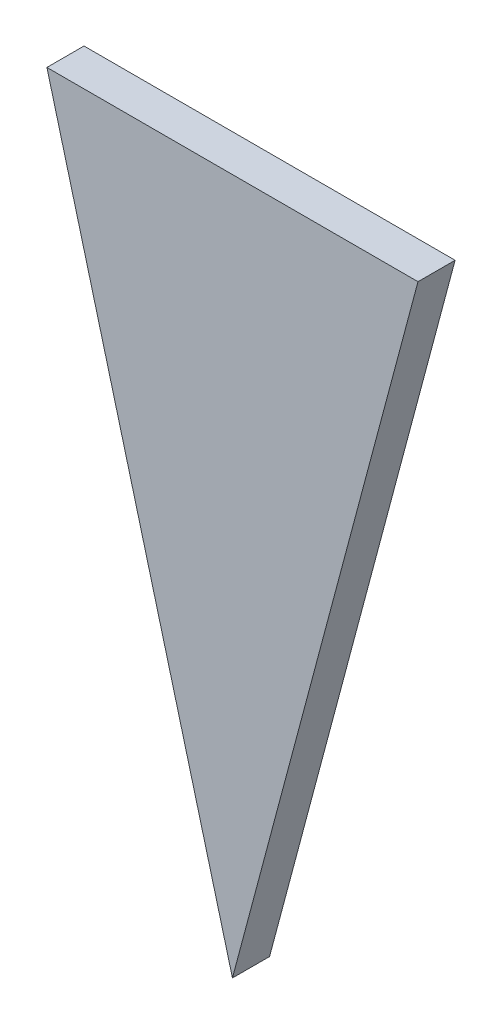
ISO-10303-21;
HEADER;
FILE_DESCRIPTION(('STEP AP214'),'2;1');
FILE_NAME('part.step','',(''),(''),'','','');
FILE_SCHEMA(('AUTOMOTIVE_DESIGN { 1 0 10303 214 1 1 1 1 }'));
ENDSEC;
DATA;
#1=APPLICATION_CONTEXT('core data for automotive mechanical design processes');
#2=APPLICATION_PROTOCOL_DEFINITION('international standard','automotive_design',2000,#1);
#3=PRODUCT_CONTEXT('',#1,'mechanical');
#4=PRODUCT('Part','Part','',(#3));
#5=PRODUCT_RELATED_PRODUCT_CATEGORY('part','',(#4));
#6=PRODUCT_DEFINITION_FORMATION('','',#4);
#7=PRODUCT_DEFINITION_CONTEXT('part definition',#1,'design');
#8=PRODUCT_DEFINITION('design','',#6,#7);
#9=PRODUCT_DEFINITION_SHAPE('','',#8);
#10=(LENGTH_UNIT() NAMED_UNIT(*) SI_UNIT(.MILLI.,.METRE.));
#11=(NAMED_UNIT(*) PLANE_ANGLE_UNIT() SI_UNIT($,.RADIAN.));
#12=(NAMED_UNIT(*) SI_UNIT($,.STERADIAN.) SOLID_ANGLE_UNIT());
#13=UNCERTAINTY_MEASURE_WITH_UNIT(LENGTH_MEASURE(1.E-05),#10,'distance_accuracy_value','');
#14=(GEOMETRIC_REPRESENTATION_CONTEXT(3) GLOBAL_UNCERTAINTY_ASSIGNED_CONTEXT((#13)) GLOBAL_UNIT_ASSIGNED_CONTEXT((#10,
#11,#12)) REPRESENTATION_CONTEXT('',''));
#15=CARTESIAN_POINT('',(0.,0.,0.));
#16=DIRECTION('',(0.,0.,1.));
#17=DIRECTION('',(1.,0.,0.));
#18=AXIS2_PLACEMENT_3D('',#15,#16,#17);
#19=CARTESIAN_POINT('',(0.,0.,0.2032));
#20=DIRECTION('',(0.,0.,1.));
#21=DIRECTION('',(1.,0.,0.));
#22=AXIS2_PLACEMENT_3D('',#19,#20,#21);
#23=PLANE('',#22);
#24=DIRECTION('',(-1.,0.,0.));
#25=VECTOR('',#24,1.);
#26=CARTESIAN_POINT('',(1.016,0.,0.2032));
#27=LINE('',#26,#25);
#28=CARTESIAN_POINT('',(1.016,0.,0.2032));
#29=VERTEX_POINT('',#28);
#30=CARTESIAN_POINT('',(-1.016,0.,0.2032));
#31=VERTEX_POINT('',#30);
#32=EDGE_CURVE('E10',#29,#31,#27,.T.);
#33=ORIENTED_EDGE('',*,*,#32,.T.);
#34=DIRECTION('',(0.257662650560332,-0.966234939601246,0.));
#35=VECTOR('',#34,1.);
#36=CARTESIAN_POINT('',(-1.016,0.,0.2032));
#37=LINE('',#36,#35);
#38=CARTESIAN_POINT('',(0.,-3.81,0.2032));
#39=VERTEX_POINT('',#38);
#40=EDGE_CURVE('E23',#31,#39,#37,.T.);
#41=ORIENTED_EDGE('',*,*,#40,.T.);
#42=DIRECTION('',(0.257662650560332,0.966234939601246,0.));
#43=VECTOR('',#42,1.);
#44=CARTESIAN_POINT('',(0.,-3.81,0.2032));
#45=LINE('',#44,#43);
#46=EDGE_CURVE('E139',#39,#29,#45,.T.);
#47=ORIENTED_EDGE('',*,*,#46,.T.);
#48=EDGE_LOOP('',(#33,#41,#47));
#49=FACE_BOUND('',#48,.T.);
#50=ADVANCED_FACE('F15',(#49),#23,.T.);
#51=CARTESIAN_POINT('',(0.,-3.81,0.2032));
#52=DIRECTION('',(-0.966234939601246,0.257662650560332,0.));
#53=DIRECTION('',(-0.257662650560332,-0.966234939601246,0.));
#54=AXIS2_PLACEMENT_3D('',#51,#52,#53);
#55=PLANE('',#54);
#56=DIRECTION('',(0.257662650560332,0.966234939601246,0.));
#57=VECTOR('',#56,1.);
#58=CARTESIAN_POINT('',(0.,-3.81,0.));
#59=LINE('',#58,#57);
#60=CARTESIAN_POINT('',(0.,-3.81,0.));
#61=VERTEX_POINT('',#60);
#62=CARTESIAN_POINT('',(1.016,0.,0.));
#63=VERTEX_POINT('',#62);
#64=EDGE_CURVE('E135',#61,#63,#59,.T.);
#65=ORIENTED_EDGE('',*,*,#64,.T.);
#66=DIRECTION('',(0.,0.,-1.));
#67=VECTOR('',#66,1.);
#68=CARTESIAN_POINT('',(1.016,0.,0.2032));
#69=LINE('',#68,#67);
#70=EDGE_CURVE('E130',#29,#63,#69,.T.);
#71=ORIENTED_EDGE('',*,*,#70,.F.);
#72=ORIENTED_EDGE('',*,*,#46,.F.);
#73=DIRECTION('',(0.,0.,-1.));
#74=VECTOR('',#73,1.);
#75=CARTESIAN_POINT('',(0.,-3.81,0.2032));
#76=LINE('',#75,#74);
#77=EDGE_CURVE('E126',#39,#61,#76,.T.);
#78=ORIENTED_EDGE('',*,*,#77,.T.);
#79=EDGE_LOOP('',(#65,#71,#72,#78));
#80=FACE_BOUND('',#79,.T.);
#81=ADVANCED_FACE('F150',(#80),#55,.F.);
#82=CARTESIAN_POINT('',(-1.016,0.,0.2032));
#83=DIRECTION('',(0.966234939601246,0.257662650560332,0.));
#84=DIRECTION('',(-0.257662650560332,0.966234939601246,0.));
#85=AXIS2_PLACEMENT_3D('',#82,#83,#84);
#86=PLANE('',#85);
#87=DIRECTION('',(0.257662650560332,-0.966234939601246,0.));
#88=VECTOR('',#87,1.);
#89=CARTESIAN_POINT('',(-1.016,0.,0.));
#90=LINE('',#89,#88);
#91=CARTESIAN_POINT('',(-1.016,0.,0.));
#92=VERTEX_POINT('',#91);
#93=EDGE_CURVE('E121',#92,#61,#90,.T.);
#94=ORIENTED_EDGE('',*,*,#93,.T.);
#95=ORIENTED_EDGE('',*,*,#77,.F.);
#96=ORIENTED_EDGE('',*,*,#40,.F.);
#97=DIRECTION('',(0.,0.,-1.));
#98=VECTOR('',#97,1.);
#99=CARTESIAN_POINT('',(-1.016,0.,0.2032));
#100=LINE('',#99,#98);
#101=EDGE_CURVE('E117',#31,#92,#100,.T.);
#102=ORIENTED_EDGE('',*,*,#101,.T.);
#103=EDGE_LOOP('',(#94,#95,#96,#102));
#104=FACE_BOUND('',#103,.T.);
#105=ADVANCED_FACE('F158',(#104),#86,.F.);
#106=CARTESIAN_POINT('',(1.016,0.,0.2032));
#107=DIRECTION('',(0.,-1.,0.));
#108=DIRECTION('',(0.,0.,-1.));
#109=AXIS2_PLACEMENT_3D('',#106,#107,#108);
#110=PLANE('',#109);
#111=DIRECTION('',(-1.,0.,0.));
#112=VECTOR('',#111,1.);
#113=CARTESIAN_POINT('',(1.016,0.,0.));
#114=LINE('',#113,#112);
#115=EDGE_CURVE('E112',#63,#92,#114,.T.);
#116=ORIENTED_EDGE('',*,*,#115,.T.);
#117=ORIENTED_EDGE('',*,*,#101,.F.);
#118=ORIENTED_EDGE('',*,*,#32,.F.);
#119=ORIENTED_EDGE('',*,*,#70,.T.);
#120=EDGE_LOOP('',(#116,#117,#118,#119));
#121=FACE_BOUND('',#120,.T.);
#122=ADVANCED_FACE('F155',(#121),#110,.F.);
#123=CARTESIAN_POINT('',(0.,0.,0.));
#124=DIRECTION('',(0.,0.,1.));
#125=DIRECTION('',(1.,0.,0.));
#126=AXIS2_PLACEMENT_3D('',#123,#124,#125);
#127=PLANE('',#126);
#128=ORIENTED_EDGE('',*,*,#115,.F.);
#129=ORIENTED_EDGE('',*,*,#64,.F.);
#130=ORIENTED_EDGE('',*,*,#93,.F.);
#131=EDGE_LOOP('',(#128,#129,#130));
#132=FACE_BOUND('',#131,.T.);
#133=DIRECTION('',(-1.,0.,0.));
#134=VECTOR('',#133,1.);
#135=CARTESIAN_POINT('',(0.850695320905,-0.127,0.));
#136=LINE('',#135,#134);
#137=CARTESIAN_POINT('',(0.850695320905,-0.127,0.));
#138=VERTEX_POINT('',#137);
#139=CARTESIAN_POINT('',(-0.850695320905,-0.127,0.));
#140=VERTEX_POINT('',#139);
#141=EDGE_CURVE('E108',#138,#140,#136,.T.);
#142=ORIENTED_EDGE('',*,*,#141,.T.);
#143=DIRECTION('',(0.257662650560336,-0.966234939601245,0.));
#144=VECTOR('',#143,1.);
#145=CARTESIAN_POINT('',(-0.850695320905,-0.127,0.));
#146=LINE('',#145,#144);
#147=CARTESIAN_POINT('',(0.,-3.31710745339369,0.));
#148=VERTEX_POINT('',#147);
#149=EDGE_CURVE('E81',#140,#148,#146,.T.);
#150=ORIENTED_EDGE('',*,*,#149,.T.);
#151=DIRECTION('',(0.257662650560336,0.966234939601245,0.));
#152=VECTOR('',#151,1.);
#153=CARTESIAN_POINT('',(0.,-3.31710745339369,0.));
#154=LINE('',#153,#152);
#155=EDGE_CURVE('E101',#148,#138,#154,.T.);
#156=ORIENTED_EDGE('',*,*,#155,.T.);
#157=EDGE_LOOP('',(#142,#150,#156));
#158=FACE_BOUND('',#157,.T.);
#159=ADVANCED_FACE('F160',(#132,#158),#127,.F.);
#160=CARTESIAN_POINT('',(0.,-3.31710745339369,0.1778));
#161=DIRECTION('',(-0.966234939601245,0.257662650560336,0.));
#162=DIRECTION('',(-0.257662650560336,-0.966234939601245,0.));
#163=AXIS2_PLACEMENT_3D('',#160,#161,#162);
#164=PLANE('',#163);
#165=ORIENTED_EDGE('',*,*,#155,.F.);
#166=DIRECTION('',(0.,0.,-1.));
#167=VECTOR('',#166,1.);
#168=CARTESIAN_POINT('',(0.,-3.31710745339369,0.1778));
#169=LINE('',#168,#167);
#170=CARTESIAN_POINT('',(0.,-3.31710745339369,0.1778));
#171=VERTEX_POINT('',#170);
#172=EDGE_CURVE('E97',#171,#148,#169,.T.);
#173=ORIENTED_EDGE('',*,*,#172,.F.);
#174=DIRECTION('',(0.257662650560336,0.966234939601245,0.));
#175=VECTOR('',#174,1.);
#176=CARTESIAN_POINT('',(0.,-3.31710745339369,0.1778));
#177=LINE('',#176,#175);
#178=CARTESIAN_POINT('',(0.850695320905,-0.127,0.1778));
#179=VERTEX_POINT('',#178);
#180=EDGE_CURVE('E84',#171,#179,#177,.T.);
#181=ORIENTED_EDGE('',*,*,#180,.T.);
#182=DIRECTION('',(0.,0.,-1.));
#183=VECTOR('',#182,1.);
#184=CARTESIAN_POINT('',(0.850695320905,-0.127,0.1778));
#185=LINE('',#184,#183);
#186=EDGE_CURVE('E71',#179,#138,#185,.T.);
#187=ORIENTED_EDGE('',*,*,#186,.T.);
#188=EDGE_LOOP('',(#165,#173,#181,#187));
#189=FACE_BOUND('',#188,.T.);
#190=ADVANCED_FACE('F163',(#189),#164,.T.);
#191=CARTESIAN_POINT('',(0.850695320905,-0.127,0.1778));
#192=DIRECTION('',(0.,-1.,0.));
#193=DIRECTION('',(0.,0.,-1.));
#194=AXIS2_PLACEMENT_3D('',#191,#192,#193);
#195=PLANE('',#194);
#196=ORIENTED_EDGE('',*,*,#141,.F.);
#197=ORIENTED_EDGE('',*,*,#186,.F.);
#198=DIRECTION('',(-1.,0.,0.));
#199=VECTOR('',#198,1.);
#200=CARTESIAN_POINT('',(0.850695320905,-0.127,0.1778));
#201=LINE('',#200,#199);
#202=CARTESIAN_POINT('',(-0.850695320905,-0.127,0.1778));
#203=VERTEX_POINT('',#202);
#204=EDGE_CURVE('E64',#179,#203,#201,.T.);
#205=ORIENTED_EDGE('',*,*,#204,.T.);
#206=DIRECTION('',(0.,0.,-1.));
#207=VECTOR('',#206,1.);
#208=CARTESIAN_POINT('',(-0.850695320905,-0.127,0.1778));
#209=LINE('',#208,#207);
#210=EDGE_CURVE('E68',#203,#140,#209,.T.);
#211=ORIENTED_EDGE('',*,*,#210,.T.);
#212=EDGE_LOOP('',(#196,#197,#205,#211));
#213=FACE_BOUND('',#212,.T.);
#214=ADVANCED_FACE('F67',(#213),#195,.T.);
#215=CARTESIAN_POINT('',(-0.850695320905,-0.127,0.1778));
#216=DIRECTION('',(0.966234939601245,0.257662650560336,0.));
#217=DIRECTION('',(-0.257662650560336,0.966234939601245,0.));
#218=AXIS2_PLACEMENT_3D('',#215,#216,#217);
#219=PLANE('',#218);
#220=ORIENTED_EDGE('',*,*,#149,.F.);
#221=ORIENTED_EDGE('',*,*,#210,.F.);
#222=DIRECTION('',(0.257662650560336,-0.966234939601245,0.));
#223=VECTOR('',#222,1.);
#224=CARTESIAN_POINT('',(-0.850695320905,-0.127,0.1778));
#225=LINE('',#224,#223);
#226=EDGE_CURVE('E80',#203,#171,#225,.T.);
#227=ORIENTED_EDGE('',*,*,#226,.T.);
#228=ORIENTED_EDGE('',*,*,#172,.T.);
#229=EDGE_LOOP('',(#220,#221,#227,#228));
#230=FACE_BOUND('',#229,.T.);
#231=ADVANCED_FACE('F78',(#230),#219,.T.);
#232=CARTESIAN_POINT('',(0.,0.,0.1778));
#233=DIRECTION('',(0.,0.,1.));
#234=DIRECTION('',(1.,0.,0.));
#235=AXIS2_PLACEMENT_3D('',#232,#233,#234);
#236=PLANE('',#235);
#237=ORIENTED_EDGE('',*,*,#204,.F.);
#238=ORIENTED_EDGE('',*,*,#180,.F.);
#239=ORIENTED_EDGE('',*,*,#226,.F.);
#240=EDGE_LOOP('',(#237,#238,#239));
#241=FACE_BOUND('',#240,.T.);
#242=ADVANCED_FACE('F83',(#241),#236,.F.);
#243=CLOSED_SHELL('',(#50,#81,#105,#122,#159,#190,#214,#231,#242));
#244=MANIFOLD_SOLID_BREP('B1',#243);
#245=ADVANCED_BREP_SHAPE_REPRESENTATION('',(#18,#244),#14);
#246=SHAPE_DEFINITION_REPRESENTATION(#9,#245);
ENDSEC;
END-ISO-10303-21;
